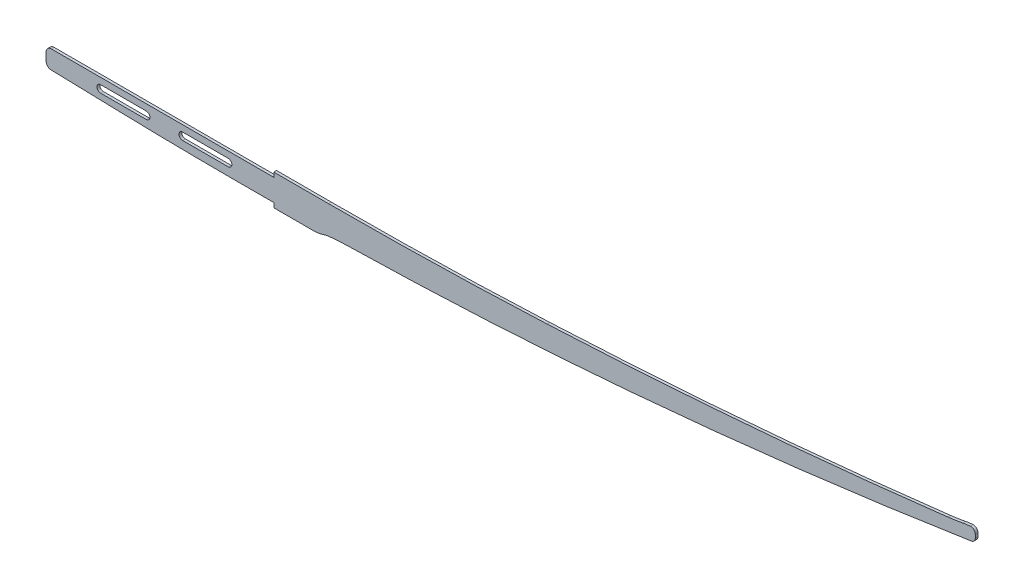
ISO-10303-21;
HEADER;
FILE_DESCRIPTION(('STEP AP214'),'2;1');
FILE_NAME('part.step','',(''),(''),'','','');
FILE_SCHEMA(('AUTOMOTIVE_DESIGN { 1 0 10303 214 1 1 1 1 }'));
ENDSEC;
DATA;
#1=APPLICATION_CONTEXT('core data for automotive mechanical design processes');
#2=APPLICATION_PROTOCOL_DEFINITION('international standard','automotive_design',2000,#1);
#3=PRODUCT_CONTEXT('',#1,'mechanical');
#4=PRODUCT('Part','Part','',(#3));
#5=PRODUCT_RELATED_PRODUCT_CATEGORY('part','',(#4));
#6=PRODUCT_DEFINITION_FORMATION('','',#4);
#7=PRODUCT_DEFINITION_CONTEXT('part definition',#1,'design');
#8=PRODUCT_DEFINITION('design','',#6,#7);
#9=PRODUCT_DEFINITION_SHAPE('','',#8);
#10=(LENGTH_UNIT() NAMED_UNIT(*) SI_UNIT(.MILLI.,.METRE.));
#11=(NAMED_UNIT(*) PLANE_ANGLE_UNIT() SI_UNIT($,.RADIAN.));
#12=(NAMED_UNIT(*) SI_UNIT($,.STERADIAN.) SOLID_ANGLE_UNIT());
#13=UNCERTAINTY_MEASURE_WITH_UNIT(LENGTH_MEASURE(1.E-05),#10,'distance_accuracy_value','');
#14=(GEOMETRIC_REPRESENTATION_CONTEXT(3) GLOBAL_UNCERTAINTY_ASSIGNED_CONTEXT((#13)) GLOBAL_UNIT_ASSIGNED_CONTEXT((#10,
#11,#12)) REPRESENTATION_CONTEXT('',''));
#15=CARTESIAN_POINT('',(0.,0.,0.));
#16=DIRECTION('',(0.,0.,1.));
#17=DIRECTION('',(1.,0.,0.));
#18=AXIS2_PLACEMENT_3D('',#15,#16,#17);
#19=CARTESIAN_POINT('',(59.9999999999986,5217.,1.5));
#20=DIRECTION('',(0.,0.,1.));
#21=DIRECTION('',(1.,0.,0.));
#22=AXIS2_PLACEMENT_3D('',#19,#20,#21);
#23=PLANE('',#22);
#24=DIRECTION('',(0.,-1.,0.));
#25=VECTOR('',#24,1.);
#26=CARTESIAN_POINT('',(0.,12.,1.5));
#27=LINE('',#26,#25);
#28=CARTESIAN_POINT('',(0.,16.9999999999993,1.5));
#29=VERTEX_POINT('',#28);
#30=CARTESIAN_POINT('',(0.,12.,1.5));
#31=VERTEX_POINT('',#30);
#32=EDGE_CURVE('E342',#29,#31,#27,.T.);
#33=ORIENTED_EDGE('',*,*,#32,.T.);
#34=DIRECTION('',(-1.,0.,0.));
#35=VECTOR('',#34,1.);
#36=CARTESIAN_POINT('',(0.,12.,1.5));
#37=LINE('',#36,#35);
#38=CARTESIAN_POINT('',(-244.,12.,1.5));
#39=VERTEX_POINT('',#38);
#40=EDGE_CURVE('E346',#31,#39,#37,.T.);
#41=ORIENTED_EDGE('',*,*,#40,.T.);
#42=CARTESIAN_POINT('',(-244.,5.99999999999998,1.5));
#43=DIRECTION('',(0.,0.,1.));
#44=DIRECTION('',(1.,0.,0.));
#45=AXIS2_PLACEMENT_3D('',#42,#43,#44);
#46=CIRCLE('',#45,6.);
#47=CARTESIAN_POINT('',(-250.,5.99999999999998,1.5));
#48=VERTEX_POINT('',#47);
#49=EDGE_CURVE('E350',#39,#48,#46,.T.);
#50=ORIENTED_EDGE('',*,*,#49,.T.);
#51=DIRECTION('',(0.,-1.,0.));
#52=VECTOR('',#51,1.);
#53=CARTESIAN_POINT('',(-250.,5.99999999999998,1.5));
#54=LINE('',#53,#52);
#55=CARTESIAN_POINT('',(-250.,-2.16324840416386,1.5));
#56=VERTEX_POINT('',#55);
#57=EDGE_CURVE('E353',#48,#56,#54,.T.);
#58=ORIENTED_EDGE('',*,*,#57,.T.);
#59=CARTESIAN_POINT('',(-244.,-2.16324840416388,1.5));
#60=DIRECTION('',(0.,0.,1.));
#61=DIRECTION('',(-1.,0.,0.));
#62=AXIS2_PLACEMENT_3D('',#59,#60,#61);
#63=CIRCLE('',#62,5.99999999999999);
#64=CARTESIAN_POINT('',(-244.165468396263,-8.16096632099174,1.5));
#65=VERTEX_POINT('',#64);
#66=EDGE_CURVE('E356',#56,#65,#63,.T.);
#67=ORIENTED_EDGE('',*,*,#66,.T.);
#68=DIRECTION('',(0.999619652804645,-0.0275780660438728,0.));
#69=VECTOR('',#68,1.);
#70=CARTESIAN_POINT('',(-170.,-10.2070847420014,1.5));
#71=LINE('',#70,#69);
#72=CARTESIAN_POINT('',(-170.,-10.2070847420014,1.5));
#73=VERTEX_POINT('',#72);
#74=EDGE_CURVE('E359',#65,#73,#71,.T.);
#75=ORIENTED_EDGE('',*,*,#74,.T.);
#76=CARTESIAN_POINT('',(-40.,4701.89109711779,1.5));
#77=DIRECTION('',(0.,0.,1.));
#78=DIRECTION('',(-1.,0.,0.));
#79=AXIS2_PLACEMENT_3D('',#76,#77,#78);
#80=CIRCLE('',#79,4713.89109711779);
#81=CARTESIAN_POINT('',(-39.9999999999991,-11.9999999999987,1.5));
#82=VERTEX_POINT('',#81);
#83=EDGE_CURVE('E362',#73,#82,#80,.T.);
#84=ORIENTED_EDGE('',*,*,#83,.T.);
#85=DIRECTION('',(1.,0.,0.));
#86=VECTOR('',#85,1.);
#87=CARTESIAN_POINT('',(-40.,-12.,1.5));
#88=LINE('',#87,#86);
#89=CARTESIAN_POINT('',(0.,-12.,1.5));
#90=VERTEX_POINT('',#89);
#91=EDGE_CURVE('E365',#82,#90,#88,.T.);
#92=ORIENTED_EDGE('',*,*,#91,.T.);
#93=DIRECTION('',(0.,-1.,0.));
#94=VECTOR('',#93,1.);
#95=CARTESIAN_POINT('',(0.,-12.,1.5));
#96=LINE('',#95,#94);
#97=CARTESIAN_POINT('',(0.,-16.9999999999993,1.5));
#98=VERTEX_POINT('',#97);
#99=EDGE_CURVE('E368',#90,#98,#96,.T.);
#100=ORIENTED_EDGE('',*,*,#99,.T.);
#101=DIRECTION('',(1.,0.,0.));
#102=VECTOR('',#101,1.);
#103=CARTESIAN_POINT('',(0.,-16.9999999999993,1.5));
#104=LINE('',#103,#102);
#105=CARTESIAN_POINT('',(44.1455769657561,-17.,1.5));
#106=VERTEX_POINT('',#105);
#107=EDGE_CURVE('E371',#98,#106,#104,.T.);
#108=ORIENTED_EDGE('',*,*,#107,.T.);
#109=CARTESIAN_POINT('',(44.1455769657561,12.9999999999999,1.5));
#110=DIRECTION('',(0.,0.,1.));
#111=DIRECTION('',(-1.,0.,0.));
#112=AXIS2_PLACEMENT_3D('',#109,#110,#111);
#113=CIRCLE('',#112,30.);
#114=CARTESIAN_POINT('',(53.8172533079623,-15.3982160836136,1.5));
#115=VERTEX_POINT('',#114);
#116=EDGE_CURVE('E374',#106,#115,#113,.T.);
#117=ORIENTED_EDGE('',*,*,#116,.T.);
#118=CARTESIAN_POINT('',(63.4889296501684,-43.7964321672272,1.5));
#119=DIRECTION('',(0.,0.,-1.));
#120=DIRECTION('',(-1.,0.,0.));
#121=AXIS2_PLACEMENT_3D('',#118,#119,#120);
#122=CIRCLE('',#121,30.);
#123=CARTESIAN_POINT('',(60.,-14.,1.5));
#124=VERTEX_POINT('',#123);
#125=EDGE_CURVE('E377',#115,#124,#122,.T.);
#126=ORIENTED_EDGE('',*,*,#125,.T.);
#127=CARTESIAN_POINT('',(84.327519327667,-221.763799252677,1.5));
#128=DIRECTION('',(0.,0.,-1.));
#129=DIRECTION('',(-1.,0.,0.));
#130=AXIS2_PLACEMENT_3D('',#127,#128,#129);
#131=CIRCLE('',#130,209.183231824506);
#132=CARTESIAN_POINT('',(80.,-12.6253354230566,1.5));
#133=VERTEX_POINT('',#132);
#134=EDGE_CURVE('E380',#124,#133,#131,.T.);
#135=ORIENTED_EDGE('',*,*,#134,.T.);
#136=CARTESIAN_POINT('',(-19.3009458340732,4786.34740071084,1.5));
#137=DIRECTION('',(0.,0.,1.));
#138=DIRECTION('',(1.,0.,0.));
#139=AXIS2_PLACEMENT_3D('',#136,#137,#138);
#140=CIRCLE('',#139,4800.);
#141=CARTESIAN_POINT('',(390.,3.82999501963521,1.5));
#142=VERTEX_POINT('',#141);
#143=EDGE_CURVE('E383',#133,#142,#140,.T.);
#144=ORIENTED_EDGE('',*,*,#143,.T.);
#145=CARTESIAN_POINT('',(-78.9906671015422,5483.79785570747,1.5));
#146=DIRECTION('',(0.,0.,1.));
#147=DIRECTION('',(1.,0.,0.));
#148=AXIS2_PLACEMENT_3D('',#145,#146,#147);
#149=CIRCLE('',#148,5500.);
#150=CARTESIAN_POINT('',(765.767962390446,49.0593286117296,1.5));
#151=VERTEX_POINT('',#150);
#152=EDGE_CURVE('E386',#142,#151,#149,.T.);
#153=ORIENTED_EDGE('',*,*,#152,.T.);
#154=CARTESIAN_POINT('',(765.,54.,1.5));
#155=DIRECTION('',(0.,0.,1.));
#156=DIRECTION('',(-1.,0.,0.));
#157=AXIS2_PLACEMENT_3D('',#154,#155,#156);
#158=CIRCLE('',#157,5.);
#159=CARTESIAN_POINT('',(770.,54.,1.5));
#160=VERTEX_POINT('',#159);
#161=EDGE_CURVE('E389',#151,#160,#158,.T.);
#162=ORIENTED_EDGE('',*,*,#161,.T.);
#163=DIRECTION('',(2.23533562347465E-12,1.,0.));
#164=VECTOR('',#163,1.);
#165=CARTESIAN_POINT('',(770.000000000008,57.6753542939809,1.5));
#166=LINE('',#165,#164);
#167=CARTESIAN_POINT('',(770.000000000008,57.6753542939809,1.5));
#168=VERTEX_POINT('',#167);
#169=EDGE_CURVE('E392',#160,#168,#166,.T.);
#170=ORIENTED_EDGE('',*,*,#169,.T.);
#171=CARTESIAN_POINT('',(765.000000000008,57.6753542939809,1.5));
#172=DIRECTION('',(0.,0.,1.));
#173=DIRECTION('',(1.,0.,0.));
#174=AXIS2_PLACEMENT_3D('',#171,#172,#173);
#175=CIRCLE('',#174,4.99999999999996);
#176=CARTESIAN_POINT('',(764.600000000008,62.6593286117317,1.5));
#177=VERTEX_POINT('',#176);
#178=EDGE_CURVE('E395',#168,#177,#175,.T.);
#179=ORIENTED_EDGE('',*,*,#178,.T.);
#180=CARTESIAN_POINT('',(771.147363155497,-18.9203959281311,1.5));
#181=DIRECTION('',(0.,0.,1.));
#182=DIRECTION('',(1.,0.,0.));
#183=AXIS2_PLACEMENT_3D('',#180,#181,#182);
#184=CIRCLE('',#183,81.8420394436121);
#185=CARTESIAN_POINT('',(756.000000000001,61.5076887794215,1.5));
#186=VERTEX_POINT('',#185);
#187=EDGE_CURVE('E398',#177,#186,#184,.T.);
#188=ORIENTED_EDGE('',*,*,#187,.T.);
#189=CARTESIAN_POINT('',(711.125873792138,299.776223492257,1.5));
#190=DIRECTION('',(0.,0.,-1.));
#191=DIRECTION('',(-1.,0.,0.));
#192=AXIS2_PLACEMENT_3D('',#189,#190,#191);
#193=CIRCLE('',#192,242.457381486152);
#194=CARTESIAN_POINT('',(740.,59.0442840391518,1.5));
#195=VERTEX_POINT('',#194);
#196=EDGE_CURVE('E401',#186,#195,#193,.T.);
#197=ORIENTED_EDGE('',*,*,#196,.T.);
#198=CARTESIAN_POINT('',(21.5669747692696,6048.82815787339,1.5));
#199=DIRECTION('',(0.,0.,-1.));
#200=DIRECTION('',(1.,0.,0.));
#201=AXIS2_PLACEMENT_3D('',#198,#199,#200);
#202=CIRCLE('',#201,6032.7155466661);
#203=CARTESIAN_POINT('',(299.999999999991,22.5414141606626,1.5));
#204=VERTEX_POINT('',#203);
#205=EDGE_CURVE('E404',#195,#204,#202,.T.);
#206=ORIENTED_EDGE('',*,*,#205,.T.);
#207=CARTESIAN_POINT('',(59.9999999999986,5217.,1.5));
#208=DIRECTION('',(0.,0.,-1.));
#209=DIRECTION('',(1.,0.,0.));
#210=AXIS2_PLACEMENT_3D('',#207,#208,#209);
#211=CIRCLE('',#210,5200.);
#212=CARTESIAN_POINT('',(59.9999999999977,16.9999999999995,1.5));
#213=VERTEX_POINT('',#212);
#214=EDGE_CURVE('E407',#204,#213,#211,.T.);
#215=ORIENTED_EDGE('',*,*,#214,.T.);
#216=DIRECTION('',(-1.,0.,0.));
#217=VECTOR('',#216,1.);
#218=CARTESIAN_POINT('',(0.,16.9999999999993,1.5));
#219=LINE('',#218,#217);
#220=EDGE_CURVE('E410',#213,#29,#219,.T.);
#221=ORIENTED_EDGE('',*,*,#220,.T.);
#222=EDGE_LOOP('',(#33,#41,#50,#58,#67,#75,#84,#92,#100,#108,#117,#126,#135,#144,#153,#162,#170,
#179,#188,#197,#206,#215,#221));
#223=FACE_BOUND('',#222,.T.);
#224=DIRECTION('',(-1.,0.,0.));
#225=VECTOR('',#224,1.);
#226=CARTESIAN_POINT('',(-50.,5.,1.5));
#227=LINE('',#226,#225);
#228=CARTESIAN_POINT('',(-50.,5.,1.5));
#229=VERTEX_POINT('',#228);
#230=CARTESIAN_POINT('',(-100.,4.99999999999999,1.5));
#231=VERTEX_POINT('',#230);
#232=EDGE_CURVE('E302',#229,#231,#227,.T.);
#233=ORIENTED_EDGE('',*,*,#232,.F.);
#234=CARTESIAN_POINT('',(-50.,0.999999999999997,1.5));
#235=DIRECTION('',(0.,0.,1.));
#236=DIRECTION('',(1.,0.,0.));
#237=AXIS2_PLACEMENT_3D('',#234,#235,#236);
#238=CIRCLE('',#237,4.);
#239=CARTESIAN_POINT('',(-50.,-3.,1.5));
#240=VERTEX_POINT('',#239);
#241=EDGE_CURVE('E299',#240,#229,#238,.T.);
#242=ORIENTED_EDGE('',*,*,#241,.F.);
#243=DIRECTION('',(1.,0.,0.));
#244=VECTOR('',#243,1.);
#245=CARTESIAN_POINT('',(-50.,-3.,1.5));
#246=LINE('',#245,#244);
#247=CARTESIAN_POINT('',(-100.,-3.00000000000013,1.5));
#248=VERTEX_POINT('',#247);
#249=EDGE_CURVE('E310',#248,#240,#246,.T.);
#250=ORIENTED_EDGE('',*,*,#249,.F.);
#251=CARTESIAN_POINT('',(-100.,0.999999999999994,1.5));
#252=DIRECTION('',(0.,0.,1.));
#253=DIRECTION('',(1.,0.,0.));
#254=AXIS2_PLACEMENT_3D('',#251,#252,#253);
#255=CIRCLE('',#254,4.);
#256=EDGE_CURVE('E306',#231,#248,#255,.T.);
#257=ORIENTED_EDGE('',*,*,#256,.F.);
#258=EDGE_LOOP('',(#233,#242,#250,#257));
#259=FACE_BOUND('',#258,.T.);
#260=DIRECTION('',(-1.,0.,0.));
#261=VECTOR('',#260,1.);
#262=CARTESIAN_POINT('',(-140.,4.99999999999999,1.5));
#263=LINE('',#262,#261);
#264=CARTESIAN_POINT('',(-140.,4.99999999999999,1.5));
#265=VERTEX_POINT('',#264);
#266=CARTESIAN_POINT('',(-190.,4.99999999999998,1.5));
#267=VERTEX_POINT('',#266);
#268=EDGE_CURVE('E260',#265,#267,#263,.T.);
#269=ORIENTED_EDGE('',*,*,#268,.F.);
#270=CARTESIAN_POINT('',(-140.,0.999999999999989,1.5));
#271=DIRECTION('',(0.,0.,1.));
#272=DIRECTION('',(1.,0.,0.));
#273=AXIS2_PLACEMENT_3D('',#270,#271,#272);
#274=CIRCLE('',#273,4.);
#275=CARTESIAN_POINT('',(-140.,-3.00000000000001,1.5));
#276=VERTEX_POINT('',#275);
#277=EDGE_CURVE('E251',#276,#265,#274,.T.);
#278=ORIENTED_EDGE('',*,*,#277,.F.);
#279=DIRECTION('',(1.,0.,0.));
#280=VECTOR('',#279,1.);
#281=CARTESIAN_POINT('',(-140.,-3.00000000000001,1.5));
#282=LINE('',#281,#280);
#283=CARTESIAN_POINT('',(-190.,-3.00000000000014,1.5));
#284=VERTEX_POINT('',#283);
#285=EDGE_CURVE('E277',#284,#276,#282,.T.);
#286=ORIENTED_EDGE('',*,*,#285,.F.);
#287=CARTESIAN_POINT('',(-190.,0.999999999999983,1.5));
#288=DIRECTION('',(0.,0.,1.));
#289=DIRECTION('',(1.,0.,0.));
#290=AXIS2_PLACEMENT_3D('',#287,#288,#289);
#291=CIRCLE('',#290,4.);
#292=EDGE_CURVE('E273',#267,#284,#291,.T.);
#293=ORIENTED_EDGE('',*,*,#292,.F.);
#294=EDGE_LOOP('',(#269,#278,#286,#293));
#295=FACE_BOUND('',#294,.T.);
#296=ADVANCED_FACE('F47',(#223,#259,#295),#23,.T.);
#297=CARTESIAN_POINT('',(59.9999999999986,5217.,-1.5));
#298=DIRECTION('',(0.,0.,1.));
#299=DIRECTION('',(1.,0.,0.));
#300=AXIS2_PLACEMENT_3D('',#297,#298,#299);
#301=PLANE('',#300);
#302=CARTESIAN_POINT('',(-50.,0.999999999999997,-1.5));
#303=DIRECTION('',(0.,0.,1.));
#304=DIRECTION('',(1.,0.,0.));
#305=AXIS2_PLACEMENT_3D('',#302,#303,#304);
#306=CIRCLE('',#305,4.);
#307=CARTESIAN_POINT('',(-50.,-3.00000000000012,-1.5));
#308=VERTEX_POINT('',#307);
#309=CARTESIAN_POINT('',(-50.,5.,-1.5));
#310=VERTEX_POINT('',#309);
#311=EDGE_CURVE('E269',#308,#310,#306,.T.);
#312=ORIENTED_EDGE('',*,*,#311,.T.);
#313=DIRECTION('',(-1.,0.,0.));
#314=VECTOR('',#313,1.);
#315=CARTESIAN_POINT('',(-50.,5.,-1.5));
#316=LINE('',#315,#314);
#317=CARTESIAN_POINT('',(-100.,4.99999999999999,-1.5));
#318=VERTEX_POINT('',#317);
#319=EDGE_CURVE('E317',#310,#318,#316,.T.);
#320=ORIENTED_EDGE('',*,*,#319,.T.);
#321=CARTESIAN_POINT('',(-100.,0.999999999999994,-1.5));
#322=DIRECTION('',(0.,0.,1.));
#323=DIRECTION('',(1.,0.,0.));
#324=AXIS2_PLACEMENT_3D('',#321,#322,#323);
#325=CIRCLE('',#324,4.);
#326=CARTESIAN_POINT('',(-100.,-3.00000000000001,-1.5));
#327=VERTEX_POINT('',#326);
#328=EDGE_CURVE('E321',#318,#327,#325,.T.);
#329=ORIENTED_EDGE('',*,*,#328,.T.);
#330=DIRECTION('',(1.,0.,0.));
#331=VECTOR('',#330,1.);
#332=CARTESIAN_POINT('',(-50.,-3.,-1.5));
#333=LINE('',#332,#331);
#334=EDGE_CURVE('E303',#327,#308,#333,.T.);
#335=ORIENTED_EDGE('',*,*,#334,.T.);
#336=EDGE_LOOP('',(#312,#320,#329,#335));
#337=FACE_BOUND('',#336,.T.);
#338=DIRECTION('',(0.,-1.,0.));
#339=VECTOR('',#338,1.);
#340=CARTESIAN_POINT('',(0.,12.,-1.5));
#341=LINE('',#340,#339);
#342=CARTESIAN_POINT('',(0.,16.9999999999993,-1.5));
#343=VERTEX_POINT('',#342);
#344=CARTESIAN_POINT('',(0.,12.,-1.5));
#345=VERTEX_POINT('',#344);
#346=EDGE_CURVE('E341',#343,#345,#341,.T.);
#347=ORIENTED_EDGE('',*,*,#346,.F.);
#348=DIRECTION('',(-1.,0.,0.));
#349=VECTOR('',#348,1.);
#350=CARTESIAN_POINT('',(0.,16.9999999999993,-1.5));
#351=LINE('',#350,#349);
#352=CARTESIAN_POINT('',(59.9999999999977,16.9999999999995,-1.5));
#353=VERTEX_POINT('',#352);
#354=EDGE_CURVE('E347',#353,#343,#351,.T.);
#355=ORIENTED_EDGE('',*,*,#354,.F.);
#356=CARTESIAN_POINT('',(59.9999999999986,5217.,-1.5));
#357=DIRECTION('',(0.,0.,-1.));
#358=DIRECTION('',(1.,0.,0.));
#359=AXIS2_PLACEMENT_3D('',#356,#357,#358);
#360=CIRCLE('',#359,5200.);
#361=CARTESIAN_POINT('',(299.999999999991,22.5414141606626,-1.5));
#362=VERTEX_POINT('',#361);
#363=EDGE_CURVE('E477',#362,#353,#360,.T.);
#364=ORIENTED_EDGE('',*,*,#363,.F.);
#365=CARTESIAN_POINT('',(21.5669747692696,6048.82815787339,-1.5));
#366=DIRECTION('',(0.,0.,-1.));
#367=DIRECTION('',(1.,0.,0.));
#368=AXIS2_PLACEMENT_3D('',#365,#366,#367);
#369=CIRCLE('',#368,6032.7155466661);
#370=CARTESIAN_POINT('',(740.,59.0442840391518,-1.5));
#371=VERTEX_POINT('',#370);
#372=EDGE_CURVE('E474',#371,#362,#369,.T.);
#373=ORIENTED_EDGE('',*,*,#372,.F.);
#374=CARTESIAN_POINT('',(711.125873792138,299.776223492257,-1.5));
#375=DIRECTION('',(0.,0.,-1.));
#376=DIRECTION('',(-1.,0.,0.));
#377=AXIS2_PLACEMENT_3D('',#374,#375,#376);
#378=CIRCLE('',#377,242.457381486152);
#379=CARTESIAN_POINT('',(756.000000000001,61.5076887794215,-1.5));
#380=VERTEX_POINT('',#379);
#381=EDGE_CURVE('E471',#380,#371,#378,.T.);
#382=ORIENTED_EDGE('',*,*,#381,.F.);
#383=CARTESIAN_POINT('',(771.147363155497,-18.9203959281311,-1.5));
#384=DIRECTION('',(0.,0.,1.));
#385=DIRECTION('',(1.,0.,0.));
#386=AXIS2_PLACEMENT_3D('',#383,#384,#385);
#387=CIRCLE('',#386,81.8420394436121);
#388=CARTESIAN_POINT('',(764.600000000008,62.6593286117317,-1.5));
#389=VERTEX_POINT('',#388);
#390=EDGE_CURVE('E468',#389,#380,#387,.T.);
#391=ORIENTED_EDGE('',*,*,#390,.F.);
#392=CARTESIAN_POINT('',(765.000000000008,57.6753542939809,-1.5));
#393=DIRECTION('',(0.,0.,1.));
#394=DIRECTION('',(1.,0.,0.));
#395=AXIS2_PLACEMENT_3D('',#392,#393,#394);
#396=CIRCLE('',#395,4.99999999999996);
#397=CARTESIAN_POINT('',(770.000000000008,57.6753542939809,-1.5));
#398=VERTEX_POINT('',#397);
#399=EDGE_CURVE('E465',#398,#389,#396,.T.);
#400=ORIENTED_EDGE('',*,*,#399,.F.);
#401=DIRECTION('',(2.23533562347465E-12,1.,0.));
#402=VECTOR('',#401,1.);
#403=CARTESIAN_POINT('',(770.000000000008,57.6753542939809,-1.5));
#404=LINE('',#403,#402);
#405=CARTESIAN_POINT('',(770.,54.,-1.5));
#406=VERTEX_POINT('',#405);
#407=EDGE_CURVE('E462',#406,#398,#404,.T.);
#408=ORIENTED_EDGE('',*,*,#407,.F.);
#409=CARTESIAN_POINT('',(765.,54.,-1.5));
#410=DIRECTION('',(0.,0.,1.));
#411=DIRECTION('',(-1.,0.,0.));
#412=AXIS2_PLACEMENT_3D('',#409,#410,#411);
#413=CIRCLE('',#412,5.);
#414=CARTESIAN_POINT('',(765.767962390446,49.0593286117296,-1.5));
#415=VERTEX_POINT('',#414);
#416=EDGE_CURVE('E459',#415,#406,#413,.T.);
#417=ORIENTED_EDGE('',*,*,#416,.F.);
#418=CARTESIAN_POINT('',(-78.9906671015422,5483.79785570747,-1.5));
#419=DIRECTION('',(0.,0.,1.));
#420=DIRECTION('',(1.,0.,0.));
#421=AXIS2_PLACEMENT_3D('',#418,#419,#420);
#422=CIRCLE('',#421,5500.);
#423=CARTESIAN_POINT('',(390.,3.82999501963521,-1.5));
#424=VERTEX_POINT('',#423);
#425=EDGE_CURVE('E456',#424,#415,#422,.T.);
#426=ORIENTED_EDGE('',*,*,#425,.F.);
#427=CARTESIAN_POINT('',(-19.3009458340732,4786.34740071084,-1.5));
#428=DIRECTION('',(0.,0.,1.));
#429=DIRECTION('',(1.,0.,0.));
#430=AXIS2_PLACEMENT_3D('',#427,#428,#429);
#431=CIRCLE('',#430,4800.);
#432=CARTESIAN_POINT('',(80.,-12.6253354230566,-1.5));
#433=VERTEX_POINT('',#432);
#434=EDGE_CURVE('E453',#433,#424,#431,.T.);
#435=ORIENTED_EDGE('',*,*,#434,.F.);
#436=CARTESIAN_POINT('',(84.327519327667,-221.763799252677,-1.5));
#437=DIRECTION('',(0.,0.,-1.));
#438=DIRECTION('',(-1.,0.,0.));
#439=AXIS2_PLACEMENT_3D('',#436,#437,#438);
#440=CIRCLE('',#439,209.183231824506);
#441=CARTESIAN_POINT('',(60.,-14.,-1.5));
#442=VERTEX_POINT('',#441);
#443=EDGE_CURVE('E450',#442,#433,#440,.T.);
#444=ORIENTED_EDGE('',*,*,#443,.F.);
#445=CARTESIAN_POINT('',(63.4889296501684,-43.7964321672272,-1.5));
#446=DIRECTION('',(0.,0.,-1.));
#447=DIRECTION('',(-1.,0.,0.));
#448=AXIS2_PLACEMENT_3D('',#445,#446,#447);
#449=CIRCLE('',#448,30.);
#450=CARTESIAN_POINT('',(53.8172533079623,-15.3982160836136,-1.5));
#451=VERTEX_POINT('',#450);
#452=EDGE_CURVE('E447',#451,#442,#449,.T.);
#453=ORIENTED_EDGE('',*,*,#452,.F.);
#454=CARTESIAN_POINT('',(44.1455769657561,12.9999999999999,-1.5));
#455=DIRECTION('',(0.,0.,1.));
#456=DIRECTION('',(-1.,0.,0.));
#457=AXIS2_PLACEMENT_3D('',#454,#455,#456);
#458=CIRCLE('',#457,30.);
#459=CARTESIAN_POINT('',(44.1455769657561,-17.,-1.5));
#460=VERTEX_POINT('',#459);
#461=EDGE_CURVE('E444',#460,#451,#458,.T.);
#462=ORIENTED_EDGE('',*,*,#461,.F.);
#463=DIRECTION('',(1.,0.,0.));
#464=VECTOR('',#463,1.);
#465=CARTESIAN_POINT('',(0.,-16.9999999999993,-1.5));
#466=LINE('',#465,#464);
#467=CARTESIAN_POINT('',(0.,-16.9999999999993,-1.5));
#468=VERTEX_POINT('',#467);
#469=EDGE_CURVE('E441',#468,#460,#466,.T.);
#470=ORIENTED_EDGE('',*,*,#469,.F.);
#471=DIRECTION('',(0.,-1.,0.));
#472=VECTOR('',#471,1.);
#473=CARTESIAN_POINT('',(0.,-12.,-1.5));
#474=LINE('',#473,#472);
#475=CARTESIAN_POINT('',(0.,-12.,-1.5));
#476=VERTEX_POINT('',#475);
#477=EDGE_CURVE('E438',#476,#468,#474,.T.);
#478=ORIENTED_EDGE('',*,*,#477,.F.);
#479=DIRECTION('',(1.,0.,0.));
#480=VECTOR('',#479,1.);
#481=CARTESIAN_POINT('',(-40.,-12.,-1.5));
#482=LINE('',#481,#480);
#483=CARTESIAN_POINT('',(-39.9999999999991,-11.9999999999987,-1.5));
#484=VERTEX_POINT('',#483);
#485=EDGE_CURVE('E435',#484,#476,#482,.T.);
#486=ORIENTED_EDGE('',*,*,#485,.F.);
#487=CARTESIAN_POINT('',(-40.,4701.89109711779,-1.5));
#488=DIRECTION('',(0.,0.,1.));
#489=DIRECTION('',(-1.,0.,0.));
#490=AXIS2_PLACEMENT_3D('',#487,#488,#489);
#491=CIRCLE('',#490,4713.89109711779);
#492=CARTESIAN_POINT('',(-170.,-10.2070847420014,-1.5));
#493=VERTEX_POINT('',#492);
#494=EDGE_CURVE('E432',#493,#484,#491,.T.);
#495=ORIENTED_EDGE('',*,*,#494,.F.);
#496=DIRECTION('',(0.999619652804645,-0.0275780660438728,0.));
#497=VECTOR('',#496,1.);
#498=CARTESIAN_POINT('',(-170.,-10.2070847420014,-1.5));
#499=LINE('',#498,#497);
#500=CARTESIAN_POINT('',(-244.165468396263,-8.16096632099174,-1.5));
#501=VERTEX_POINT('',#500);
#502=EDGE_CURVE('E429',#501,#493,#499,.T.);
#503=ORIENTED_EDGE('',*,*,#502,.F.);
#504=CARTESIAN_POINT('',(-244.,-2.16324840416388,-1.5));
#505=DIRECTION('',(0.,0.,1.));
#506=DIRECTION('',(-1.,0.,0.));
#507=AXIS2_PLACEMENT_3D('',#504,#505,#506);
#508=CIRCLE('',#507,5.99999999999999);
#509=CARTESIAN_POINT('',(-250.,-2.16324840416386,-1.5));
#510=VERTEX_POINT('',#509);
#511=EDGE_CURVE('E426',#510,#501,#508,.T.);
#512=ORIENTED_EDGE('',*,*,#511,.F.);
#513=DIRECTION('',(0.,-1.,0.));
#514=VECTOR('',#513,1.);
#515=CARTESIAN_POINT('',(-250.,5.99999999999998,-1.5));
#516=LINE('',#515,#514);
#517=CARTESIAN_POINT('',(-250.,5.99999999999998,-1.5));
#518=VERTEX_POINT('',#517);
#519=EDGE_CURVE('E423',#518,#510,#516,.T.);
#520=ORIENTED_EDGE('',*,*,#519,.F.);
#521=CARTESIAN_POINT('',(-244.,5.99999999999998,-1.5));
#522=DIRECTION('',(0.,0.,1.));
#523=DIRECTION('',(1.,0.,0.));
#524=AXIS2_PLACEMENT_3D('',#521,#522,#523);
#525=CIRCLE('',#524,6.);
#526=CARTESIAN_POINT('',(-244.,12.,-1.5));
#527=VERTEX_POINT('',#526);
#528=EDGE_CURVE('E420',#527,#518,#525,.T.);
#529=ORIENTED_EDGE('',*,*,#528,.F.);
#530=DIRECTION('',(-1.,0.,0.));
#531=VECTOR('',#530,1.);
#532=CARTESIAN_POINT('',(0.,12.,-1.5));
#533=LINE('',#532,#531);
#534=EDGE_CURVE('E417',#345,#527,#533,.T.);
#535=ORIENTED_EDGE('',*,*,#534,.F.);
#536=EDGE_LOOP('',(#347,#355,#364,#373,#382,#391,#400,#408,#417,#426,#435,#444,#453,#462,#470,
#478,#486,#495,#503,#512,#520,#529,#535));
#537=FACE_BOUND('',#536,.T.);
#538=CARTESIAN_POINT('',(-140.,0.999999999999989,-1.5));
#539=DIRECTION('',(0.,0.,1.));
#540=DIRECTION('',(1.,0.,0.));
#541=AXIS2_PLACEMENT_3D('',#538,#539,#540);
#542=CIRCLE('',#541,4.);
#543=CARTESIAN_POINT('',(-140.,-3.00000000000014,-1.5));
#544=VERTEX_POINT('',#543);
#545=CARTESIAN_POINT('',(-140.,4.99999999999999,-1.5));
#546=VERTEX_POINT('',#545);
#547=EDGE_CURVE('E71',#544,#546,#542,.T.);
#548=ORIENTED_EDGE('',*,*,#547,.T.);
#549=DIRECTION('',(-1.,0.,0.));
#550=VECTOR('',#549,1.);
#551=CARTESIAN_POINT('',(-140.,4.99999999999999,-1.5));
#552=LINE('',#551,#550);
#553=CARTESIAN_POINT('',(-190.,4.99999999999998,-1.5));
#554=VERTEX_POINT('',#553);
#555=EDGE_CURVE('E267',#546,#554,#552,.T.);
#556=ORIENTED_EDGE('',*,*,#555,.T.);
#557=CARTESIAN_POINT('',(-190.,0.999999999999983,-1.5));
#558=DIRECTION('',(0.,0.,1.));
#559=DIRECTION('',(1.,0.,0.));
#560=AXIS2_PLACEMENT_3D('',#557,#558,#559);
#561=CIRCLE('',#560,4.);
#562=CARTESIAN_POINT('',(-190.,-3.00000000000002,-1.5));
#563=VERTEX_POINT('',#562);
#564=EDGE_CURVE('E286',#554,#563,#561,.T.);
#565=ORIENTED_EDGE('',*,*,#564,.T.);
#566=DIRECTION('',(1.,0.,0.));
#567=VECTOR('',#566,1.);
#568=CARTESIAN_POINT('',(-140.,-3.00000000000001,-1.5));
#569=LINE('',#568,#567);
#570=EDGE_CURVE('E261',#563,#544,#569,.T.);
#571=ORIENTED_EDGE('',*,*,#570,.T.);
#572=EDGE_LOOP('',(#548,#556,#565,#571));
#573=FACE_BOUND('',#572,.T.);
#574=ADVANCED_FACE('F576',(#337,#537,#573),#301,.F.);
#575=CARTESIAN_POINT('',(0.,12.,1.5));
#576=DIRECTION('',(1.,0.,0.));
#577=DIRECTION('',(0.,1.,0.));
#578=AXIS2_PLACEMENT_3D('',#575,#576,#577);
#579=PLANE('',#578);
#580=ORIENTED_EDGE('',*,*,#346,.T.);
#581=DIRECTION('',(0.,0.,-1.));
#582=VECTOR('',#581,1.);
#583=CARTESIAN_POINT('',(0.,12.,1.5));
#584=LINE('',#583,#582);
#585=EDGE_CURVE('E11',#31,#345,#584,.T.);
#586=ORIENTED_EDGE('',*,*,#585,.F.);
#587=ORIENTED_EDGE('',*,*,#32,.F.);
#588=DIRECTION('',(0.,0.,-1.));
#589=VECTOR('',#588,1.);
#590=CARTESIAN_POINT('',(0.,16.9999999999993,1.5));
#591=LINE('',#590,#589);
#592=EDGE_CURVE('E413',#29,#343,#591,.T.);
#593=ORIENTED_EDGE('',*,*,#592,.T.);
#594=EDGE_LOOP('',(#580,#586,#587,#593));
#595=FACE_BOUND('',#594,.T.);
#596=ADVANCED_FACE('F49',(#595),#579,.F.);
#597=CARTESIAN_POINT('',(0.,12.,1.5));
#598=DIRECTION('',(0.,-1.,0.));
#599=DIRECTION('',(1.,0.,0.));
#600=AXIS2_PLACEMENT_3D('',#597,#598,#599);
#601=PLANE('',#600);
#602=ORIENTED_EDGE('',*,*,#534,.T.);
#603=DIRECTION('',(0.,0.,-1.));
#604=VECTOR('',#603,1.);
#605=CARTESIAN_POINT('',(-244.,12.,1.5));
#606=LINE('',#605,#604);
#607=EDGE_CURVE('E56',#39,#527,#606,.T.);
#608=ORIENTED_EDGE('',*,*,#607,.F.);
#609=ORIENTED_EDGE('',*,*,#40,.F.);
#610=ORIENTED_EDGE('',*,*,#585,.T.);
#611=EDGE_LOOP('',(#602,#608,#609,#610));
#612=FACE_BOUND('',#611,.T.);
#613=ADVANCED_FACE('F594',(#612),#601,.F.);
#614=CARTESIAN_POINT('',(-244.,5.99999999999998,1.5));
#615=DIRECTION('',(0.,0.,-1.));
#616=DIRECTION('',(-1.,0.,0.));
#617=AXIS2_PLACEMENT_3D('',#614,#615,#616);
#618=CYLINDRICAL_SURFACE('',#617,6.);
#619=ORIENTED_EDGE('',*,*,#528,.T.);
#620=DIRECTION('',(0.,0.,-1.));
#621=VECTOR('',#620,1.);
#622=CARTESIAN_POINT('',(-250.,5.99999999999998,1.5));
#623=LINE('',#622,#621);
#624=EDGE_CURVE('E561',#48,#518,#623,.T.);
#625=ORIENTED_EDGE('',*,*,#624,.F.);
#626=ORIENTED_EDGE('',*,*,#49,.F.);
#627=ORIENTED_EDGE('',*,*,#607,.T.);
#628=EDGE_LOOP('',(#619,#625,#626,#627));
#629=FACE_BOUND('',#628,.T.);
#630=ADVANCED_FACE('F570',(#629),#618,.T.);
#631=CARTESIAN_POINT('',(-250.,5.99999999999998,1.5));
#632=DIRECTION('',(1.,0.,0.));
#633=DIRECTION('',(0.,0.,-1.));
#634=AXIS2_PLACEMENT_3D('',#631,#632,#633);
#635=PLANE('',#634);
#636=ORIENTED_EDGE('',*,*,#519,.T.);
#637=DIRECTION('',(0.,0.,-1.));
#638=VECTOR('',#637,1.);
#639=CARTESIAN_POINT('',(-250.,-2.16324840416386,1.5));
#640=LINE('',#639,#638);
#641=EDGE_CURVE('E557',#56,#510,#640,.T.);
#642=ORIENTED_EDGE('',*,*,#641,.F.);
#643=ORIENTED_EDGE('',*,*,#57,.F.);
#644=ORIENTED_EDGE('',*,*,#624,.T.);
#645=EDGE_LOOP('',(#636,#642,#643,#644));
#646=FACE_BOUND('',#645,.T.);
#647=ADVANCED_FACE('F582',(#646),#635,.F.);
#648=CARTESIAN_POINT('',(-244.,-2.16324840416388,1.5));
#649=DIRECTION('',(0.,0.,-1.));
#650=DIRECTION('',(-1.,0.,0.));
#651=AXIS2_PLACEMENT_3D('',#648,#649,#650);
#652=CYLINDRICAL_SURFACE('',#651,5.99999999999999);
#653=ORIENTED_EDGE('',*,*,#511,.T.);
#654=DIRECTION('',(0.,0.,-1.));
#655=VECTOR('',#654,1.);
#656=CARTESIAN_POINT('',(-244.165468396263,-8.16096632099174,1.5));
#657=LINE('',#656,#655);
#658=EDGE_CURVE('E553',#65,#501,#657,.T.);
#659=ORIENTED_EDGE('',*,*,#658,.F.);
#660=ORIENTED_EDGE('',*,*,#66,.F.);
#661=ORIENTED_EDGE('',*,*,#641,.T.);
#662=EDGE_LOOP('',(#653,#659,#660,#661));
#663=FACE_BOUND('',#662,.T.);
#664=ADVANCED_FACE('F586',(#663),#652,.T.);
#665=CARTESIAN_POINT('',(-170.,-10.2070847420014,1.5));
#666=DIRECTION('',(0.0275780660438728,0.999619652804645,0.));
#667=DIRECTION('',(-0.999619652804645,0.0275780660438728,0.));
#668=AXIS2_PLACEMENT_3D('',#665,#666,#667);
#669=PLANE('',#668);
#670=ORIENTED_EDGE('',*,*,#502,.T.);
#671=DIRECTION('',(0.,0.,-1.));
#672=VECTOR('',#671,1.);
#673=CARTESIAN_POINT('',(-170.,-10.2070847420014,1.5));
#674=LINE('',#673,#672);
#675=EDGE_CURVE('E549',#73,#493,#674,.T.);
#676=ORIENTED_EDGE('',*,*,#675,.F.);
#677=ORIENTED_EDGE('',*,*,#74,.F.);
#678=ORIENTED_EDGE('',*,*,#658,.T.);
#679=EDGE_LOOP('',(#670,#676,#677,#678));
#680=FACE_BOUND('',#679,.T.);
#681=ADVANCED_FACE('F682',(#680),#669,.F.);
#682=CARTESIAN_POINT('',(-40.,4701.89109711779,1.5));
#683=DIRECTION('',(0.,0.,-1.));
#684=DIRECTION('',(-1.,0.,0.));
#685=AXIS2_PLACEMENT_3D('',#682,#683,#684);
#686=CYLINDRICAL_SURFACE('',#685,4713.89109711779);
#687=ORIENTED_EDGE('',*,*,#494,.T.);
#688=DIRECTION('',(0.,0.,-1.));
#689=VECTOR('',#688,1.);
#690=CARTESIAN_POINT('',(-39.9999999999991,-11.9999999999987,1.5));
#691=LINE('',#690,#689);
#692=EDGE_CURVE('E545',#82,#484,#691,.T.);
#693=ORIENTED_EDGE('',*,*,#692,.F.);
#694=ORIENTED_EDGE('',*,*,#83,.F.);
#695=ORIENTED_EDGE('',*,*,#675,.T.);
#696=EDGE_LOOP('',(#687,#693,#694,#695));
#697=FACE_BOUND('',#696,.T.);
#698=ADVANCED_FACE('F680',(#697),#686,.T.);
#699=CARTESIAN_POINT('',(-40.,-12.,1.5));
#700=DIRECTION('',(0.,1.,0.));
#701=DIRECTION('',(0.,0.,1.));
#702=AXIS2_PLACEMENT_3D('',#699,#700,#701);
#703=PLANE('',#702);
#704=ORIENTED_EDGE('',*,*,#485,.T.);
#705=DIRECTION('',(0.,0.,-1.));
#706=VECTOR('',#705,1.);
#707=CARTESIAN_POINT('',(0.,-12.,1.5));
#708=LINE('',#707,#706);
#709=EDGE_CURVE('E541',#90,#476,#708,.T.);
#710=ORIENTED_EDGE('',*,*,#709,.F.);
#711=ORIENTED_EDGE('',*,*,#91,.F.);
#712=ORIENTED_EDGE('',*,*,#692,.T.);
#713=EDGE_LOOP('',(#704,#710,#711,#712));
#714=FACE_BOUND('',#713,.T.);
#715=ADVANCED_FACE('F675',(#714),#703,.F.);
#716=CARTESIAN_POINT('',(0.,-12.,1.5));
#717=DIRECTION('',(1.,0.,0.));
#718=DIRECTION('',(0.,1.,0.));
#719=AXIS2_PLACEMENT_3D('',#716,#717,#718);
#720=PLANE('',#719);
#721=ORIENTED_EDGE('',*,*,#477,.T.);
#722=DIRECTION('',(0.,0.,-1.));
#723=VECTOR('',#722,1.);
#724=CARTESIAN_POINT('',(0.,-16.9999999999993,1.5));
#725=LINE('',#724,#723);
#726=EDGE_CURVE('E537',#98,#468,#725,.T.);
#727=ORIENTED_EDGE('',*,*,#726,.F.);
#728=ORIENTED_EDGE('',*,*,#99,.F.);
#729=ORIENTED_EDGE('',*,*,#709,.T.);
#730=EDGE_LOOP('',(#721,#727,#728,#729));
#731=FACE_BOUND('',#730,.T.);
#732=ADVANCED_FACE('F670',(#731),#720,.F.);
#733=CARTESIAN_POINT('',(0.,-16.9999999999993,1.5));
#734=DIRECTION('',(0.,1.,0.));
#735=DIRECTION('',(-1.,0.,0.));
#736=AXIS2_PLACEMENT_3D('',#733,#734,#735);
#737=PLANE('',#736);
#738=ORIENTED_EDGE('',*,*,#469,.T.);
#739=DIRECTION('',(0.,0.,-1.));
#740=VECTOR('',#739,1.);
#741=CARTESIAN_POINT('',(44.1455769657561,-17.,1.5));
#742=LINE('',#741,#740);
#743=EDGE_CURVE('E533',#106,#460,#742,.T.);
#744=ORIENTED_EDGE('',*,*,#743,.F.);
#745=ORIENTED_EDGE('',*,*,#107,.F.);
#746=ORIENTED_EDGE('',*,*,#726,.T.);
#747=EDGE_LOOP('',(#738,#744,#745,#746));
#748=FACE_BOUND('',#747,.T.);
#749=ADVANCED_FACE('F666',(#748),#737,.F.);
#750=CARTESIAN_POINT('',(44.1455769657561,12.9999999999999,1.5));
#751=DIRECTION('',(0.,0.,-1.));
#752=DIRECTION('',(-1.,0.,0.));
#753=AXIS2_PLACEMENT_3D('',#750,#751,#752);
#754=CYLINDRICAL_SURFACE('',#753,30.);
#755=ORIENTED_EDGE('',*,*,#461,.T.);
#756=DIRECTION('',(0.,0.,-1.));
#757=VECTOR('',#756,1.);
#758=CARTESIAN_POINT('',(53.8172533079623,-15.3982160836136,1.5));
#759=LINE('',#758,#757);
#760=EDGE_CURVE('E529',#115,#451,#759,.T.);
#761=ORIENTED_EDGE('',*,*,#760,.F.);
#762=ORIENTED_EDGE('',*,*,#116,.F.);
#763=ORIENTED_EDGE('',*,*,#743,.T.);
#764=EDGE_LOOP('',(#755,#761,#762,#763));
#765=FACE_BOUND('',#764,.T.);
#766=ADVANCED_FACE('F661',(#765),#754,.T.);
#767=CARTESIAN_POINT('',(63.4889296501684,-43.7964321672272,1.5));
#768=DIRECTION('',(0.,0.,-1.));
#769=DIRECTION('',(-1.,0.,0.));
#770=AXIS2_PLACEMENT_3D('',#767,#768,#769);
#771=CYLINDRICAL_SURFACE('',#770,30.);
#772=ORIENTED_EDGE('',*,*,#452,.T.);
#773=DIRECTION('',(0.,0.,-1.));
#774=VECTOR('',#773,1.);
#775=CARTESIAN_POINT('',(60.,-14.,1.5));
#776=LINE('',#775,#774);
#777=EDGE_CURVE('E525',#124,#442,#776,.T.);
#778=ORIENTED_EDGE('',*,*,#777,.F.);
#779=ORIENTED_EDGE('',*,*,#125,.F.);
#780=ORIENTED_EDGE('',*,*,#760,.T.);
#781=EDGE_LOOP('',(#772,#778,#779,#780));
#782=FACE_BOUND('',#781,.T.);
#783=ADVANCED_FACE('F655',(#782),#771,.F.);
#784=CARTESIAN_POINT('',(84.327519327667,-221.763799252677,1.5));
#785=DIRECTION('',(0.,0.,-1.));
#786=DIRECTION('',(-1.,0.,0.));
#787=AXIS2_PLACEMENT_3D('',#784,#785,#786);
#788=CYLINDRICAL_SURFACE('',#787,209.183231824506);
#789=ORIENTED_EDGE('',*,*,#443,.T.);
#790=DIRECTION('',(0.,0.,-1.));
#791=VECTOR('',#790,1.);
#792=CARTESIAN_POINT('',(80.,-12.6253354230566,1.5));
#793=LINE('',#792,#791);
#794=EDGE_CURVE('E521',#133,#433,#793,.T.);
#795=ORIENTED_EDGE('',*,*,#794,.F.);
#796=ORIENTED_EDGE('',*,*,#134,.F.);
#797=ORIENTED_EDGE('',*,*,#777,.T.);
#798=EDGE_LOOP('',(#789,#795,#796,#797));
#799=FACE_BOUND('',#798,.T.);
#800=ADVANCED_FACE('F651',(#799),#788,.F.);
#801=CARTESIAN_POINT('',(-19.3009458340732,4786.34740071084,1.5));
#802=DIRECTION('',(0.,0.,-1.));
#803=DIRECTION('',(-1.,0.,0.));
#804=AXIS2_PLACEMENT_3D('',#801,#802,#803);
#805=CYLINDRICAL_SURFACE('',#804,4800.);
#806=ORIENTED_EDGE('',*,*,#434,.T.);
#807=DIRECTION('',(0.,0.,-1.));
#808=VECTOR('',#807,1.);
#809=CARTESIAN_POINT('',(390.,3.82999501963521,1.5));
#810=LINE('',#809,#808);
#811=EDGE_CURVE('E517',#142,#424,#810,.T.);
#812=ORIENTED_EDGE('',*,*,#811,.F.);
#813=ORIENTED_EDGE('',*,*,#143,.F.);
#814=ORIENTED_EDGE('',*,*,#794,.T.);
#815=EDGE_LOOP('',(#806,#812,#813,#814));
#816=FACE_BOUND('',#815,.T.);
#817=ADVANCED_FACE('F646',(#816),#805,.T.);
#818=CARTESIAN_POINT('',(-78.9906671015422,5483.79785570747,1.5));
#819=DIRECTION('',(0.,0.,-1.));
#820=DIRECTION('',(-1.,0.,0.));
#821=AXIS2_PLACEMENT_3D('',#818,#819,#820);
#822=CYLINDRICAL_SURFACE('',#821,5500.);
#823=ORIENTED_EDGE('',*,*,#425,.T.);
#824=DIRECTION('',(0.,0.,-1.));
#825=VECTOR('',#824,1.);
#826=CARTESIAN_POINT('',(765.767962390446,49.0593286117296,1.5));
#827=LINE('',#826,#825);
#828=EDGE_CURVE('E513',#151,#415,#827,.T.);
#829=ORIENTED_EDGE('',*,*,#828,.F.);
#830=ORIENTED_EDGE('',*,*,#152,.F.);
#831=ORIENTED_EDGE('',*,*,#811,.T.);
#832=EDGE_LOOP('',(#823,#829,#830,#831));
#833=FACE_BOUND('',#832,.T.);
#834=ADVANCED_FACE('F640',(#833),#822,.T.);
#835=CARTESIAN_POINT('',(765.,54.,1.5));
#836=DIRECTION('',(0.,0.,-1.));
#837=DIRECTION('',(-1.,0.,0.));
#838=AXIS2_PLACEMENT_3D('',#835,#836,#837);
#839=CYLINDRICAL_SURFACE('',#838,5.);
#840=ORIENTED_EDGE('',*,*,#416,.T.);
#841=DIRECTION('',(0.,0.,-1.));
#842=VECTOR('',#841,1.);
#843=CARTESIAN_POINT('',(770.,54.,1.5));
#844=LINE('',#843,#842);
#845=EDGE_CURVE('E509',#160,#406,#844,.T.);
#846=ORIENTED_EDGE('',*,*,#845,.F.);
#847=ORIENTED_EDGE('',*,*,#161,.F.);
#848=ORIENTED_EDGE('',*,*,#828,.T.);
#849=EDGE_LOOP('',(#840,#846,#847,#848));
#850=FACE_BOUND('',#849,.T.);
#851=ADVANCED_FACE('F636',(#850),#839,.T.);
#852=CARTESIAN_POINT('',(770.000000000008,57.6753542939809,1.5));
#853=DIRECTION('',(-1.,2.23533562347465E-12,0.));
#854=DIRECTION('',(-2.23533562347465E-12,-1.,0.));
#855=AXIS2_PLACEMENT_3D('',#852,#853,#854);
#856=PLANE('',#855);
#857=ORIENTED_EDGE('',*,*,#407,.T.);
#858=DIRECTION('',(0.,0.,-1.));
#859=VECTOR('',#858,1.);
#860=CARTESIAN_POINT('',(770.000000000008,57.6753542939809,1.5));
#861=LINE('',#860,#859);
#862=EDGE_CURVE('E505',#168,#398,#861,.T.);
#863=ORIENTED_EDGE('',*,*,#862,.F.);
#864=ORIENTED_EDGE('',*,*,#169,.F.);
#865=ORIENTED_EDGE('',*,*,#845,.T.);
#866=EDGE_LOOP('',(#857,#863,#864,#865));
#867=FACE_BOUND('',#866,.T.);
#868=ADVANCED_FACE('F631',(#867),#856,.F.);
#869=CARTESIAN_POINT('',(765.000000000008,57.6753542939809,1.5));
#870=DIRECTION('',(0.,0.,-1.));
#871=DIRECTION('',(-1.,0.,0.));
#872=AXIS2_PLACEMENT_3D('',#869,#870,#871);
#873=CYLINDRICAL_SURFACE('',#872,4.99999999999996);
#874=ORIENTED_EDGE('',*,*,#399,.T.);
#875=DIRECTION('',(0.,0.,-1.));
#876=VECTOR('',#875,1.);
#877=CARTESIAN_POINT('',(764.600000000008,62.6593286117317,1.5));
#878=LINE('',#877,#876);
#879=EDGE_CURVE('E501',#177,#389,#878,.T.);
#880=ORIENTED_EDGE('',*,*,#879,.F.);
#881=ORIENTED_EDGE('',*,*,#178,.F.);
#882=ORIENTED_EDGE('',*,*,#862,.T.);
#883=EDGE_LOOP('',(#874,#880,#881,#882));
#884=FACE_BOUND('',#883,.T.);
#885=ADVANCED_FACE('F625',(#884),#873,.T.);
#886=CARTESIAN_POINT('',(771.147363155497,-18.9203959281311,1.5));
#887=DIRECTION('',(0.,0.,-1.));
#888=DIRECTION('',(-1.,0.,0.));
#889=AXIS2_PLACEMENT_3D('',#886,#887,#888);
#890=CYLINDRICAL_SURFACE('',#889,81.8420394436121);
#891=ORIENTED_EDGE('',*,*,#390,.T.);
#892=DIRECTION('',(0.,0.,-1.));
#893=VECTOR('',#892,1.);
#894=CARTESIAN_POINT('',(756.000000000001,61.5076887794215,1.5));
#895=LINE('',#894,#893);
#896=EDGE_CURVE('E497',#186,#380,#895,.T.);
#897=ORIENTED_EDGE('',*,*,#896,.F.);
#898=ORIENTED_EDGE('',*,*,#187,.F.);
#899=ORIENTED_EDGE('',*,*,#879,.T.);
#900=EDGE_LOOP('',(#891,#897,#898,#899));
#901=FACE_BOUND('',#900,.T.);
#902=ADVANCED_FACE('F621',(#901),#890,.T.);
#903=CARTESIAN_POINT('',(711.125873792138,299.776223492257,1.5));
#904=DIRECTION('',(0.,0.,-1.));
#905=DIRECTION('',(-1.,0.,0.));
#906=AXIS2_PLACEMENT_3D('',#903,#904,#905);
#907=CYLINDRICAL_SURFACE('',#906,242.457381486152);
#908=ORIENTED_EDGE('',*,*,#381,.T.);
#909=DIRECTION('',(0.,0.,-1.));
#910=VECTOR('',#909,1.);
#911=CARTESIAN_POINT('',(740.,59.0442840391518,1.5));
#912=LINE('',#911,#910);
#913=EDGE_CURVE('E493',#195,#371,#912,.T.);
#914=ORIENTED_EDGE('',*,*,#913,.F.);
#915=ORIENTED_EDGE('',*,*,#196,.F.);
#916=ORIENTED_EDGE('',*,*,#896,.T.);
#917=EDGE_LOOP('',(#908,#914,#915,#916));
#918=FACE_BOUND('',#917,.T.);
#919=ADVANCED_FACE('F616',(#918),#907,.F.);
#920=CARTESIAN_POINT('',(21.5669747692696,6048.82815787339,1.5));
#921=DIRECTION('',(0.,0.,-1.));
#922=DIRECTION('',(-1.,0.,0.));
#923=AXIS2_PLACEMENT_3D('',#920,#921,#922);
#924=CYLINDRICAL_SURFACE('',#923,6032.7155466661);
#925=ORIENTED_EDGE('',*,*,#372,.T.);
#926=DIRECTION('',(0.,0.,-1.));
#927=VECTOR('',#926,1.);
#928=CARTESIAN_POINT('',(299.999999999991,22.5414141606626,1.5));
#929=LINE('',#928,#927);
#930=EDGE_CURVE('E489',#204,#362,#929,.T.);
#931=ORIENTED_EDGE('',*,*,#930,.F.);
#932=ORIENTED_EDGE('',*,*,#205,.F.);
#933=ORIENTED_EDGE('',*,*,#913,.T.);
#934=EDGE_LOOP('',(#925,#931,#932,#933));
#935=FACE_BOUND('',#934,.T.);
#936=ADVANCED_FACE('F610',(#935),#924,.F.);
#937=CARTESIAN_POINT('',(59.9999999999986,5217.,1.5));
#938=DIRECTION('',(0.,0.,-1.));
#939=DIRECTION('',(-1.,0.,0.));
#940=AXIS2_PLACEMENT_3D('',#937,#938,#939);
#941=CYLINDRICAL_SURFACE('',#940,5200.);
#942=ORIENTED_EDGE('',*,*,#363,.T.);
#943=DIRECTION('',(0.,0.,-1.));
#944=VECTOR('',#943,1.);
#945=CARTESIAN_POINT('',(59.9999999999977,16.9999999999995,1.5));
#946=LINE('',#945,#944);
#947=EDGE_CURVE('E485',#213,#353,#946,.T.);
#948=ORIENTED_EDGE('',*,*,#947,.F.);
#949=ORIENTED_EDGE('',*,*,#214,.F.);
#950=ORIENTED_EDGE('',*,*,#930,.T.);
#951=EDGE_LOOP('',(#942,#948,#949,#950));
#952=FACE_BOUND('',#951,.T.);
#953=ADVANCED_FACE('F606',(#952),#941,.F.);
#954=CARTESIAN_POINT('',(0.,16.9999999999993,1.5));
#955=DIRECTION('',(0.,-1.,0.));
#956=DIRECTION('',(1.,0.,0.));
#957=AXIS2_PLACEMENT_3D('',#954,#955,#956);
#958=PLANE('',#957);
#959=ORIENTED_EDGE('',*,*,#354,.T.);
#960=ORIENTED_EDGE('',*,*,#592,.F.);
#961=ORIENTED_EDGE('',*,*,#220,.F.);
#962=ORIENTED_EDGE('',*,*,#947,.T.);
#963=EDGE_LOOP('',(#959,#960,#961,#962));
#964=FACE_BOUND('',#963,.T.);
#965=ADVANCED_FACE('F601',(#964),#958,.F.);
#966=CARTESIAN_POINT('',(-50.,0.999999999999997,1.5));
#967=DIRECTION('',(0.,0.,-1.));
#968=DIRECTION('',(-1.,0.,0.));
#969=AXIS2_PLACEMENT_3D('',#966,#967,#968);
#970=CYLINDRICAL_SURFACE('',#969,4.);
#971=ORIENTED_EDGE('',*,*,#311,.F.);
#972=DIRECTION('',(0.,0.,-1.));
#973=VECTOR('',#972,1.);
#974=CARTESIAN_POINT('',(-50.,-3.,1.5));
#975=LINE('',#974,#973);
#976=EDGE_CURVE('E313',#240,#308,#975,.T.);
#977=ORIENTED_EDGE('',*,*,#976,.F.);
#978=ORIENTED_EDGE('',*,*,#241,.T.);
#979=DIRECTION('',(0.,0.,-1.));
#980=VECTOR('',#979,1.);
#981=CARTESIAN_POINT('',(-50.,5.,1.5));
#982=LINE('',#981,#980);
#983=EDGE_CURVE('E337',#229,#310,#982,.T.);
#984=ORIENTED_EDGE('',*,*,#983,.T.);
#985=EDGE_LOOP('',(#971,#977,#978,#984));
#986=FACE_BOUND('',#985,.T.);
#987=ADVANCED_FACE('F699',(#986),#970,.F.);
#988=CARTESIAN_POINT('',(-50.,5.,1.5));
#989=DIRECTION('',(0.,-1.,0.));
#990=DIRECTION('',(1.,0.,0.));
#991=AXIS2_PLACEMENT_3D('',#988,#989,#990);
#992=PLANE('',#991);
#993=ORIENTED_EDGE('',*,*,#319,.F.);
#994=ORIENTED_EDGE('',*,*,#983,.F.);
#995=ORIENTED_EDGE('',*,*,#232,.T.);
#996=DIRECTION('',(0.,0.,-1.));
#997=VECTOR('',#996,1.);
#998=CARTESIAN_POINT('',(-100.,4.99999999999999,1.5));
#999=LINE('',#998,#997);
#1000=EDGE_CURVE('E334',#231,#318,#999,.T.);
#1001=ORIENTED_EDGE('',*,*,#1000,.T.);
#1002=EDGE_LOOP('',(#993,#994,#995,#1001));
#1003=FACE_BOUND('',#1002,.T.);
#1004=ADVANCED_FACE('F819',(#1003),#992,.T.);
#1005=CARTESIAN_POINT('',(-100.,0.999999999999994,1.5));
#1006=DIRECTION('',(0.,0.,-1.));
#1007=DIRECTION('',(-1.,0.,0.));
#1008=AXIS2_PLACEMENT_3D('',#1005,#1006,#1007);
#1009=CYLINDRICAL_SURFACE('',#1008,4.);
#1010=ORIENTED_EDGE('',*,*,#328,.F.);
#1011=ORIENTED_EDGE('',*,*,#1000,.F.);
#1012=ORIENTED_EDGE('',*,*,#256,.T.);
#1013=DIRECTION('',(0.,0.,-1.));
#1014=VECTOR('',#1013,1.);
#1015=CARTESIAN_POINT('',(-100.,-3.00000000000001,1.5));
#1016=LINE('',#1015,#1014);
#1017=EDGE_CURVE('E331',#248,#327,#1016,.T.);
#1018=ORIENTED_EDGE('',*,*,#1017,.T.);
#1019=EDGE_LOOP('',(#1010,#1011,#1012,#1018));
#1020=FACE_BOUND('',#1019,.T.);
#1021=ADVANCED_FACE('F827',(#1020),#1009,.F.);
#1022=CARTESIAN_POINT('',(-50.,-3.,1.5));
#1023=DIRECTION('',(0.,1.,0.));
#1024=DIRECTION('',(-1.,0.,0.));
#1025=AXIS2_PLACEMENT_3D('',#1022,#1023,#1024);
#1026=PLANE('',#1025);
#1027=ORIENTED_EDGE('',*,*,#334,.F.);
#1028=ORIENTED_EDGE('',*,*,#1017,.F.);
#1029=ORIENTED_EDGE('',*,*,#249,.T.);
#1030=ORIENTED_EDGE('',*,*,#976,.T.);
#1031=EDGE_LOOP('',(#1027,#1028,#1029,#1030));
#1032=FACE_BOUND('',#1031,.T.);
#1033=ADVANCED_FACE('F835',(#1032),#1026,.T.);
#1034=CARTESIAN_POINT('',(-140.,0.999999999999989,1.5));
#1035=DIRECTION('',(0.,0.,-1.));
#1036=DIRECTION('',(-1.,0.,0.));
#1037=AXIS2_PLACEMENT_3D('',#1034,#1035,#1036);
#1038=CYLINDRICAL_SURFACE('',#1037,4.);
#1039=ORIENTED_EDGE('',*,*,#547,.F.);
#1040=DIRECTION('',(0.,0.,-1.));
#1041=VECTOR('',#1040,1.);
#1042=CARTESIAN_POINT('',(-140.,-3.00000000000001,1.5));
#1043=LINE('',#1042,#1041);
#1044=EDGE_CURVE('E255',#276,#544,#1043,.T.);
#1045=ORIENTED_EDGE('',*,*,#1044,.F.);
#1046=ORIENTED_EDGE('',*,*,#277,.T.);
#1047=DIRECTION('',(0.,0.,-1.));
#1048=VECTOR('',#1047,1.);
#1049=CARTESIAN_POINT('',(-140.,4.99999999999999,1.5));
#1050=LINE('',#1049,#1048);
#1051=EDGE_CURVE('E254',#265,#546,#1050,.T.);
#1052=ORIENTED_EDGE('',*,*,#1051,.T.);
#1053=EDGE_LOOP('',(#1039,#1045,#1046,#1052));
#1054=FACE_BOUND('',#1053,.T.);
#1055=ADVANCED_FACE('F253',(#1054),#1038,.F.);
#1056=CARTESIAN_POINT('',(-140.,4.99999999999999,1.5));
#1057=DIRECTION('',(0.,-1.,0.));
#1058=DIRECTION('',(1.,0.,0.));
#1059=AXIS2_PLACEMENT_3D('',#1056,#1057,#1058);
#1060=PLANE('',#1059);
#1061=ORIENTED_EDGE('',*,*,#555,.F.);
#1062=ORIENTED_EDGE('',*,*,#1051,.F.);
#1063=ORIENTED_EDGE('',*,*,#268,.T.);
#1064=DIRECTION('',(0.,0.,-1.));
#1065=VECTOR('',#1064,1.);
#1066=CARTESIAN_POINT('',(-190.,4.99999999999998,1.5));
#1067=LINE('',#1066,#1065);
#1068=EDGE_CURVE('E270',#267,#554,#1067,.T.);
#1069=ORIENTED_EDGE('',*,*,#1068,.T.);
#1070=EDGE_LOOP('',(#1061,#1062,#1063,#1069));
#1071=FACE_BOUND('',#1070,.T.);
#1072=ADVANCED_FACE('F264',(#1071),#1060,.T.);
#1073=CARTESIAN_POINT('',(-190.,0.999999999999983,1.5));
#1074=DIRECTION('',(0.,0.,-1.));
#1075=DIRECTION('',(-1.,0.,0.));
#1076=AXIS2_PLACEMENT_3D('',#1073,#1074,#1075);
#1077=CYLINDRICAL_SURFACE('',#1076,4.);
#1078=ORIENTED_EDGE('',*,*,#564,.F.);
#1079=ORIENTED_EDGE('',*,*,#1068,.F.);
#1080=ORIENTED_EDGE('',*,*,#292,.T.);
#1081=DIRECTION('',(0.,0.,-1.));
#1082=VECTOR('',#1081,1.);
#1083=CARTESIAN_POINT('',(-190.,-3.00000000000002,1.5));
#1084=LINE('',#1083,#1082);
#1085=EDGE_CURVE('E63',#284,#563,#1084,.T.);
#1086=ORIENTED_EDGE('',*,*,#1085,.T.);
#1087=EDGE_LOOP('',(#1078,#1079,#1080,#1086));
#1088=FACE_BOUND('',#1087,.T.);
#1089=ADVANCED_FACE('F859',(#1088),#1077,.F.);
#1090=CARTESIAN_POINT('',(-140.,-3.00000000000001,1.5));
#1091=DIRECTION('',(0.,1.,0.));
#1092=DIRECTION('',(-1.,0.,0.));
#1093=AXIS2_PLACEMENT_3D('',#1090,#1091,#1092);
#1094=PLANE('',#1093);
#1095=ORIENTED_EDGE('',*,*,#570,.F.);
#1096=ORIENTED_EDGE('',*,*,#1085,.F.);
#1097=ORIENTED_EDGE('',*,*,#285,.T.);
#1098=ORIENTED_EDGE('',*,*,#1044,.T.);
#1099=EDGE_LOOP('',(#1095,#1096,#1097,#1098));
#1100=FACE_BOUND('',#1099,.T.);
#1101=ADVANCED_FACE('F867',(#1100),#1094,.T.);
#1102=CLOSED_SHELL('',(#296,#574,#596,#613,#630,#647,#664,#681,#698,#715,#732,#749,#766,#783,
#800,#817,#834,#851,#868,#885,#902,#919,#936,#953,#965,#987,#1004,#1021,#1033,#1055,#1072,#1089,#1101));
#1103=MANIFOLD_SOLID_BREP('B2',#1102);
#1104=ADVANCED_BREP_SHAPE_REPRESENTATION('',(#18,#1103),#14);
#1105=SHAPE_DEFINITION_REPRESENTATION(#9,#1104);
ENDSEC;
END-ISO-10303-21;
